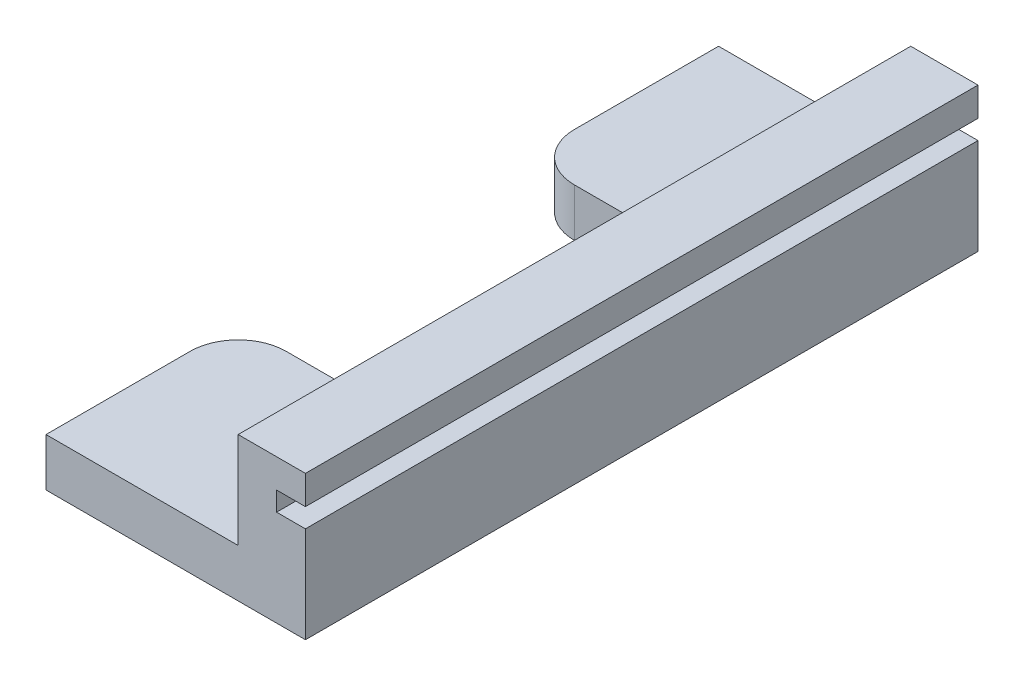
ISO-10303-21;
HEADER;
FILE_DESCRIPTION(('STEP AP214'),'2;1');
FILE_NAME('part.step','',(''),(''),'','','');
FILE_SCHEMA(('AUTOMOTIVE_DESIGN { 1 0 10303 214 1 1 1 1 }'));
ENDSEC;
DATA;
#1=APPLICATION_CONTEXT('core data for automotive mechanical design processes');
#2=APPLICATION_PROTOCOL_DEFINITION('international standard','automotive_design',2000,#1);
#3=PRODUCT_CONTEXT('',#1,'mechanical');
#4=PRODUCT('Part','Part','',(#3));
#5=PRODUCT_RELATED_PRODUCT_CATEGORY('part','',(#4));
#6=PRODUCT_DEFINITION_FORMATION('','',#4);
#7=PRODUCT_DEFINITION_CONTEXT('part definition',#1,'design');
#8=PRODUCT_DEFINITION('design','',#6,#7);
#9=PRODUCT_DEFINITION_SHAPE('','',#8);
#10=(LENGTH_UNIT() NAMED_UNIT(*) SI_UNIT(.MILLI.,.METRE.));
#11=(NAMED_UNIT(*) PLANE_ANGLE_UNIT() SI_UNIT($,.RADIAN.));
#12=(NAMED_UNIT(*) SI_UNIT($,.STERADIAN.) SOLID_ANGLE_UNIT());
#13=UNCERTAINTY_MEASURE_WITH_UNIT(LENGTH_MEASURE(1.E-05),#10,'distance_accuracy_value','');
#14=(GEOMETRIC_REPRESENTATION_CONTEXT(3) GLOBAL_UNCERTAINTY_ASSIGNED_CONTEXT((#13)) GLOBAL_UNIT_ASSIGNED_CONTEXT((#10,
#11,#12)) REPRESENTATION_CONTEXT('',''));
#15=CARTESIAN_POINT('',(0.,0.,0.));
#16=DIRECTION('',(0.,0.,1.));
#17=DIRECTION('',(1.,0.,0.));
#18=AXIS2_PLACEMENT_3D('',#15,#16,#17);
#19=CARTESIAN_POINT('',(0.,0.,0.));
#20=DIRECTION('',(0.,-1.,0.));
#21=DIRECTION('',(0.,0.,-1.));
#22=AXIS2_PLACEMENT_3D('',#19,#20,#21);
#23=PLANE('',#22);
#24=DIRECTION('',(0.,0.,1.));
#25=VECTOR('',#24,1.);
#26=CARTESIAN_POINT('',(-20.,0.,-70.));
#27=LINE('',#26,#25);
#28=CARTESIAN_POINT('',(-20.,0.,-15.));
#29=VERTEX_POINT('',#28);
#30=CARTESIAN_POINT('',(-20.,0.,0.));
#31=VERTEX_POINT('',#30);
#32=EDGE_CURVE('E184',#29,#31,#27,.T.);
#33=ORIENTED_EDGE('',*,*,#32,.F.);
#34=CARTESIAN_POINT('',(-15.,0.,-15.));
#35=DIRECTION('',(0.,-1.,0.));
#36=DIRECTION('',(0.,0.,-1.));
#37=AXIS2_PLACEMENT_3D('',#34,#35,#36);
#38=CIRCLE('',#37,5.);
#39=CARTESIAN_POINT('',(-15.,0.,-20.));
#40=VERTEX_POINT('',#39);
#41=EDGE_CURVE('E302',#29,#40,#38,.T.);
#42=ORIENTED_EDGE('',*,*,#41,.T.);
#43=DIRECTION('',(1.,0.,0.));
#44=VECTOR('',#43,1.);
#45=CARTESIAN_POINT('',(0.,0.,-20.));
#46=LINE('',#45,#44);
#47=CARTESIAN_POINT('',(-10.,0.,-20.));
#48=VERTEX_POINT('',#47);
#49=EDGE_CURVE('E354',#40,#48,#46,.T.);
#50=ORIENTED_EDGE('',*,*,#49,.T.);
#51=CARTESIAN_POINT('',(-10.,0.,-25.));
#52=DIRECTION('',(0.,-1.,0.));
#53=DIRECTION('',(0.,0.,-1.));
#54=AXIS2_PLACEMENT_3D('',#51,#52,#53);
#55=CIRCLE('',#54,5.);
#56=CARTESIAN_POINT('',(-5.,0.,-25.));
#57=VERTEX_POINT('',#56);
#58=EDGE_CURVE('E325',#48,#57,#55,.F.);
#59=ORIENTED_EDGE('',*,*,#58,.T.);
#60=DIRECTION('',(0.,0.,-1.));
#61=VECTOR('',#60,1.);
#62=CARTESIAN_POINT('',(-5.,0.,0.));
#63=LINE('',#62,#61);
#64=CARTESIAN_POINT('',(-5.,0.,-45.));
#65=VERTEX_POINT('',#64);
#66=EDGE_CURVE('E196',#57,#65,#63,.T.);
#67=ORIENTED_EDGE('',*,*,#66,.T.);
#68=CARTESIAN_POINT('',(-10.,0.,-45.));
#69=DIRECTION('',(0.,-1.,0.));
#70=DIRECTION('',(0.,0.,-1.));
#71=AXIS2_PLACEMENT_3D('',#68,#69,#70);
#72=CIRCLE('',#71,5.);
#73=CARTESIAN_POINT('',(-10.,0.,-50.));
#74=VERTEX_POINT('',#73);
#75=EDGE_CURVE('E11',#65,#74,#72,.F.);
#76=ORIENTED_EDGE('',*,*,#75,.T.);
#77=DIRECTION('',(-1.,0.,0.));
#78=VECTOR('',#77,1.);
#79=CARTESIAN_POINT('',(0.,0.,-50.));
#80=LINE('',#79,#78);
#81=CARTESIAN_POINT('',(-15.,0.,-50.));
#82=VERTEX_POINT('',#81);
#83=EDGE_CURVE('E350',#74,#82,#80,.T.);
#84=ORIENTED_EDGE('',*,*,#83,.T.);
#85=CARTESIAN_POINT('',(-15.,0.,-55.));
#86=DIRECTION('',(0.,-1.,0.));
#87=DIRECTION('',(0.,0.,-1.));
#88=AXIS2_PLACEMENT_3D('',#85,#86,#87);
#89=CIRCLE('',#88,5.);
#90=CARTESIAN_POINT('',(-20.,0.,-55.));
#91=VERTEX_POINT('',#90);
#92=EDGE_CURVE('E55',#82,#91,#89,.T.);
#93=ORIENTED_EDGE('',*,*,#92,.T.);
#94=CARTESIAN_POINT('',(-20.,0.,-70.));
#95=VERTEX_POINT('',#94);
#96=EDGE_CURVE('E179',#95,#91,#27,.T.);
#97=ORIENTED_EDGE('',*,*,#96,.F.);
#98=DIRECTION('',(-1.,0.,0.));
#99=VECTOR('',#98,1.);
#100=CARTESIAN_POINT('',(0.,0.,-70.));
#101=LINE('',#100,#99);
#102=CARTESIAN_POINT('',(7.,0.,-70.));
#103=VERTEX_POINT('',#102);
#104=EDGE_CURVE('E165',#103,#95,#101,.T.);
#105=ORIENTED_EDGE('',*,*,#104,.F.);
#106=DIRECTION('',(0.,0.,-1.));
#107=VECTOR('',#106,1.);
#108=CARTESIAN_POINT('',(7.,0.,0.));
#109=LINE('',#108,#107);
#110=CARTESIAN_POINT('',(7.,0.,0.));
#111=VERTEX_POINT('',#110);
#112=EDGE_CURVE('E214',#111,#103,#109,.T.);
#113=ORIENTED_EDGE('',*,*,#112,.F.);
#114=DIRECTION('',(1.,0.,0.));
#115=VECTOR('',#114,1.);
#116=CARTESIAN_POINT('',(0.,0.,0.));
#117=LINE('',#116,#115);
#118=EDGE_CURVE('E177',#31,#111,#117,.T.);
#119=ORIENTED_EDGE('',*,*,#118,.F.);
#120=EDGE_LOOP('',(#33,#42,#50,#59,#67,#76,#84,#93,#97,#105,#113,#119));
#121=FACE_BOUND('',#120,.T.);
#122=ADVANCED_FACE('F39',(#121),#23,.T.);
#123=CARTESIAN_POINT('',(-20.,5.,-70.));
#124=DIRECTION('',(0.,-1.,0.));
#125=DIRECTION('',(0.,0.,-1.));
#126=AXIS2_PLACEMENT_3D('',#123,#124,#125);
#127=PLANE('',#126);
#128=DIRECTION('',(-1.,0.,0.));
#129=VECTOR('',#128,1.);
#130=CARTESIAN_POINT('',(0.,5.,-20.));
#131=LINE('',#130,#129);
#132=CARTESIAN_POINT('',(-10.,5.,-20.));
#133=VERTEX_POINT('',#132);
#134=CARTESIAN_POINT('',(-15.,5.,-20.));
#135=VERTEX_POINT('',#134);
#136=EDGE_CURVE('E346',#133,#135,#131,.T.);
#137=ORIENTED_EDGE('',*,*,#136,.T.);
#138=CARTESIAN_POINT('',(-15.,5.,-15.));
#139=DIRECTION('',(0.,-1.,0.));
#140=DIRECTION('',(0.,0.,-1.));
#141=AXIS2_PLACEMENT_3D('',#138,#139,#140);
#142=CIRCLE('',#141,5.);
#143=CARTESIAN_POINT('',(-20.,5.,-15.));
#144=VERTEX_POINT('',#143);
#145=EDGE_CURVE('E294',#135,#144,#142,.F.);
#146=ORIENTED_EDGE('',*,*,#145,.T.);
#147=DIRECTION('',(0.,0.,-1.));
#148=VECTOR('',#147,1.);
#149=CARTESIAN_POINT('',(-20.,5.,-70.));
#150=LINE('',#149,#148);
#151=CARTESIAN_POINT('',(-20.,5.,0.));
#152=VERTEX_POINT('',#151);
#153=EDGE_CURVE('E203',#152,#144,#150,.T.);
#154=ORIENTED_EDGE('',*,*,#153,.F.);
#155=DIRECTION('',(1.,0.,0.));
#156=VECTOR('',#155,1.);
#157=CARTESIAN_POINT('',(-20.,5.,0.));
#158=LINE('',#157,#156);
#159=CARTESIAN_POINT('',(0.,5.,0.));
#160=VERTEX_POINT('',#159);
#161=EDGE_CURVE('E210',#152,#160,#158,.T.);
#162=ORIENTED_EDGE('',*,*,#161,.T.);
#163=DIRECTION('',(0.,0.,-1.));
#164=VECTOR('',#163,1.);
#165=CARTESIAN_POINT('',(0.,5.,-70.));
#166=LINE('',#165,#164);
#167=CARTESIAN_POINT('',(0.,5.,-70.));
#168=VERTEX_POINT('',#167);
#169=EDGE_CURVE('E191',#160,#168,#166,.T.);
#170=ORIENTED_EDGE('',*,*,#169,.T.);
#171=DIRECTION('',(1.,0.,0.));
#172=VECTOR('',#171,1.);
#173=CARTESIAN_POINT('',(-20.,5.,-70.));
#174=LINE('',#173,#172);
#175=CARTESIAN_POINT('',(-20.,5.,-70.));
#176=VERTEX_POINT('',#175);
#177=EDGE_CURVE('E206',#176,#168,#174,.T.);
#178=ORIENTED_EDGE('',*,*,#177,.F.);
#179=CARTESIAN_POINT('',(-20.,5.,-55.));
#180=VERTEX_POINT('',#179);
#181=EDGE_CURVE('E188',#180,#176,#150,.T.);
#182=ORIENTED_EDGE('',*,*,#181,.F.);
#183=CARTESIAN_POINT('',(-15.,5.,-55.));
#184=DIRECTION('',(0.,-1.,0.));
#185=DIRECTION('',(0.,0.,-1.));
#186=AXIS2_PLACEMENT_3D('',#183,#184,#185);
#187=CIRCLE('',#186,5.);
#188=CARTESIAN_POINT('',(-15.,5.,-50.));
#189=VERTEX_POINT('',#188);
#190=EDGE_CURVE('E291',#180,#189,#187,.F.);
#191=ORIENTED_EDGE('',*,*,#190,.T.);
#192=DIRECTION('',(1.,0.,0.));
#193=VECTOR('',#192,1.);
#194=CARTESIAN_POINT('',(0.,5.,-50.));
#195=LINE('',#194,#193);
#196=CARTESIAN_POINT('',(-10.,5.,-50.));
#197=VERTEX_POINT('',#196);
#198=EDGE_CURVE('E336',#189,#197,#195,.T.);
#199=ORIENTED_EDGE('',*,*,#198,.T.);
#200=CARTESIAN_POINT('',(-10.,5.,-45.));
#201=DIRECTION('',(0.,-1.,0.));
#202=DIRECTION('',(0.,0.,-1.));
#203=AXIS2_PLACEMENT_3D('',#200,#201,#202);
#204=CIRCLE('',#203,5.);
#205=CARTESIAN_POINT('',(-5.,5.,-45.));
#206=VERTEX_POINT('',#205);
#207=EDGE_CURVE('E48',#197,#206,#204,.T.);
#208=ORIENTED_EDGE('',*,*,#207,.T.);
#209=DIRECTION('',(0.,0.,1.));
#210=VECTOR('',#209,1.);
#211=CARTESIAN_POINT('',(-5.,5.,0.));
#212=LINE('',#211,#210);
#213=CARTESIAN_POINT('',(-5.,5.,-25.));
#214=VERTEX_POINT('',#213);
#215=EDGE_CURVE('E334',#206,#214,#212,.T.);
#216=ORIENTED_EDGE('',*,*,#215,.T.);
#217=CARTESIAN_POINT('',(-10.,5.,-25.));
#218=DIRECTION('',(0.,-1.,0.));
#219=DIRECTION('',(0.,0.,-1.));
#220=AXIS2_PLACEMENT_3D('',#217,#218,#219);
#221=CIRCLE('',#220,5.);
#222=EDGE_CURVE('E322',#214,#133,#221,.T.);
#223=ORIENTED_EDGE('',*,*,#222,.T.);
#224=EDGE_LOOP('',(#137,#146,#154,#162,#170,#178,#182,#191,#199,#208,#216,#223));
#225=FACE_BOUND('',#224,.T.);
#226=ADVANCED_FACE('F333',(#225),#127,.F.);
#227=CARTESIAN_POINT('',(-20.,0.,0.));
#228=DIRECTION('',(1.,0.,0.));
#229=DIRECTION('',(0.,0.,-1.));
#230=AXIS2_PLACEMENT_3D('',#227,#228,#229);
#231=PLANE('',#230);
#232=ORIENTED_EDGE('',*,*,#153,.T.);
#233=DIRECTION('',(0.,1.,0.));
#234=VECTOR('',#233,1.);
#235=CARTESIAN_POINT('',(-20.,0.,-15.));
#236=LINE('',#235,#234);
#237=EDGE_CURVE('E297',#144,#29,#236,.F.);
#238=ORIENTED_EDGE('',*,*,#237,.T.);
#239=ORIENTED_EDGE('',*,*,#32,.T.);
#240=DIRECTION('',(0.,1.,0.));
#241=VECTOR('',#240,1.);
#242=CARTESIAN_POINT('',(-20.,0.,0.));
#243=LINE('',#242,#241);
#244=EDGE_CURVE('E183',#31,#152,#243,.T.);
#245=ORIENTED_EDGE('',*,*,#244,.T.);
#246=EDGE_LOOP('',(#232,#238,#239,#245));
#247=FACE_BOUND('',#246,.T.);
#248=ADVANCED_FACE('F378',(#247),#231,.F.);
#249=ORIENTED_EDGE('',*,*,#96,.T.);
#250=DIRECTION('',(0.,-1.,0.));
#251=VECTOR('',#250,1.);
#252=CARTESIAN_POINT('',(-20.,5.,-55.));
#253=LINE('',#252,#251);
#254=EDGE_CURVE('E312',#91,#180,#253,.F.);
#255=ORIENTED_EDGE('',*,*,#254,.T.);
#256=ORIENTED_EDGE('',*,*,#181,.T.);
#257=DIRECTION('',(0.,-1.,0.));
#258=VECTOR('',#257,1.);
#259=CARTESIAN_POINT('',(-20.,0.,-70.));
#260=LINE('',#259,#258);
#261=EDGE_CURVE('E169',#176,#95,#260,.T.);
#262=ORIENTED_EDGE('',*,*,#261,.T.);
#263=EDGE_LOOP('',(#249,#255,#256,#262));
#264=FACE_BOUND('',#263,.T.);
#265=ADVANCED_FACE('F186',(#264),#231,.F.);
#266=CARTESIAN_POINT('',(0.,5.,0.));
#267=DIRECTION('',(1.,0.,0.));
#268=DIRECTION('',(0.,0.,-1.));
#269=AXIS2_PLACEMENT_3D('',#266,#267,#268);
#270=PLANE('',#269);
#271=ORIENTED_EDGE('',*,*,#169,.F.);
#272=DIRECTION('',(0.,-1.,0.));
#273=VECTOR('',#272,1.);
#274=CARTESIAN_POINT('',(0.,5.,0.));
#275=LINE('',#274,#273);
#276=CARTESIAN_POINT('',(0.,15.,0.));
#277=VERTEX_POINT('',#276);
#278=EDGE_CURVE('E280',#277,#160,#275,.T.);
#279=ORIENTED_EDGE('',*,*,#278,.F.);
#280=DIRECTION('',(0.,0.,1.));
#281=VECTOR('',#280,1.);
#282=CARTESIAN_POINT('',(0.,15.,0.));
#283=LINE('',#282,#281);
#284=CARTESIAN_POINT('',(0.,15.,-70.));
#285=VERTEX_POINT('',#284);
#286=EDGE_CURVE('E252',#285,#277,#283,.T.);
#287=ORIENTED_EDGE('',*,*,#286,.F.);
#288=DIRECTION('',(0.,-1.,0.));
#289=VECTOR('',#288,1.);
#290=CARTESIAN_POINT('',(0.,5.,-70.));
#291=LINE('',#290,#289);
#292=EDGE_CURVE('E176',#285,#168,#291,.T.);
#293=ORIENTED_EDGE('',*,*,#292,.T.);
#294=EDGE_LOOP('',(#271,#279,#287,#293));
#295=FACE_BOUND('',#294,.T.);
#296=ADVANCED_FACE('F393',(#295),#270,.F.);
#297=CARTESIAN_POINT('',(0.,5.,0.));
#298=DIRECTION('',(0.,0.,-1.));
#299=DIRECTION('',(-1.,0.,0.));
#300=AXIS2_PLACEMENT_3D('',#297,#298,#299);
#301=PLANE('',#300);
#302=ORIENTED_EDGE('',*,*,#118,.T.);
#303=DIRECTION('',(0.,-1.,0.));
#304=VECTOR('',#303,1.);
#305=CARTESIAN_POINT('',(7.,15.,0.));
#306=LINE('',#305,#304);
#307=CARTESIAN_POINT('',(7.,10.,0.));
#308=VERTEX_POINT('',#307);
#309=EDGE_CURVE('E270',#308,#111,#306,.T.);
#310=ORIENTED_EDGE('',*,*,#309,.F.);
#311=DIRECTION('',(1.,0.,0.));
#312=VECTOR('',#311,1.);
#313=CARTESIAN_POINT('',(4.,10.,0.));
#314=LINE('',#313,#312);
#315=CARTESIAN_POINT('',(4.,10.,0.));
#316=VERTEX_POINT('',#315);
#317=EDGE_CURVE('E243',#316,#308,#314,.T.);
#318=ORIENTED_EDGE('',*,*,#317,.F.);
#319=DIRECTION('',(0.,1.,0.));
#320=VECTOR('',#319,1.);
#321=CARTESIAN_POINT('',(4.,10.,0.));
#322=LINE('',#321,#320);
#323=CARTESIAN_POINT('',(4.,11.9981435230443,0.));
#324=VERTEX_POINT('',#323);
#325=EDGE_CURVE('E230',#316,#324,#322,.T.);
#326=ORIENTED_EDGE('',*,*,#325,.T.);
#327=DIRECTION('',(1.,0.,0.));
#328=VECTOR('',#327,1.);
#329=CARTESIAN_POINT('',(4.,11.9981435230443,0.));
#330=LINE('',#329,#328);
#331=CARTESIAN_POINT('',(7.,11.9981435230443,0.));
#332=VERTEX_POINT('',#331);
#333=EDGE_CURVE('E234',#324,#332,#330,.T.);
#334=ORIENTED_EDGE('',*,*,#333,.T.);
#335=CARTESIAN_POINT('',(7.,15.,0.));
#336=VERTEX_POINT('',#335);
#337=EDGE_CURVE('E271',#336,#332,#306,.T.);
#338=ORIENTED_EDGE('',*,*,#337,.F.);
#339=DIRECTION('',(1.,0.,0.));
#340=VECTOR('',#339,1.);
#341=CARTESIAN_POINT('',(0.,15.,0.));
#342=LINE('',#341,#340);
#343=EDGE_CURVE('E256',#277,#336,#342,.T.);
#344=ORIENTED_EDGE('',*,*,#343,.F.);
#345=ORIENTED_EDGE('',*,*,#278,.T.);
#346=ORIENTED_EDGE('',*,*,#161,.F.);
#347=ORIENTED_EDGE('',*,*,#244,.F.);
#348=EDGE_LOOP('',(#302,#310,#318,#326,#334,#338,#344,#345,#346,#347));
#349=FACE_BOUND('',#348,.T.);
#350=ADVANCED_FACE('F384',(#349),#301,.F.);
#351=CARTESIAN_POINT('',(0.,5.,-70.));
#352=DIRECTION('',(0.,0.,1.));
#353=DIRECTION('',(1.,0.,0.));
#354=AXIS2_PLACEMENT_3D('',#351,#352,#353);
#355=PLANE('',#354);
#356=DIRECTION('',(0.,-1.,0.));
#357=VECTOR('',#356,1.);
#358=CARTESIAN_POINT('',(7.,15.,-70.));
#359=LINE('',#358,#357);
#360=CARTESIAN_POINT('',(7.,10.,-70.));
#361=VERTEX_POINT('',#360);
#362=EDGE_CURVE('E172',#361,#103,#359,.T.);
#363=ORIENTED_EDGE('',*,*,#362,.T.);
#364=ORIENTED_EDGE('',*,*,#104,.T.);
#365=ORIENTED_EDGE('',*,*,#261,.F.);
#366=ORIENTED_EDGE('',*,*,#177,.T.);
#367=ORIENTED_EDGE('',*,*,#292,.F.);
#368=DIRECTION('',(-1.,0.,0.));
#369=VECTOR('',#368,1.);
#370=CARTESIAN_POINT('',(0.,15.,-70.));
#371=LINE('',#370,#369);
#372=CARTESIAN_POINT('',(7.,15.,-70.));
#373=VERTEX_POINT('',#372);
#374=EDGE_CURVE('E262',#373,#285,#371,.T.);
#375=ORIENTED_EDGE('',*,*,#374,.F.);
#376=CARTESIAN_POINT('',(7.,11.9981435230443,-70.));
#377=VERTEX_POINT('',#376);
#378=EDGE_CURVE('E266',#373,#377,#359,.T.);
#379=ORIENTED_EDGE('',*,*,#378,.T.);
#380=DIRECTION('',(1.,0.,0.));
#381=VECTOR('',#380,1.);
#382=CARTESIAN_POINT('',(4.,11.9981435230443,-70.));
#383=LINE('',#382,#381);
#384=CARTESIAN_POINT('',(4.,11.9981435230443,-70.));
#385=VERTEX_POINT('',#384);
#386=EDGE_CURVE('E249',#385,#377,#383,.T.);
#387=ORIENTED_EDGE('',*,*,#386,.F.);
#388=DIRECTION('',(0.,1.,0.));
#389=VECTOR('',#388,1.);
#390=CARTESIAN_POINT('',(4.,10.,-70.));
#391=LINE('',#390,#389);
#392=CARTESIAN_POINT('',(4.,10.,-70.));
#393=VERTEX_POINT('',#392);
#394=EDGE_CURVE('E221',#393,#385,#391,.T.);
#395=ORIENTED_EDGE('',*,*,#394,.F.);
#396=DIRECTION('',(1.,0.,0.));
#397=VECTOR('',#396,1.);
#398=CARTESIAN_POINT('',(4.,10.,-70.));
#399=LINE('',#398,#397);
#400=EDGE_CURVE('E246',#393,#361,#399,.T.);
#401=ORIENTED_EDGE('',*,*,#400,.T.);
#402=EDGE_LOOP('',(#363,#364,#365,#366,#367,#375,#379,#387,#395,#401));
#403=FACE_BOUND('',#402,.T.);
#404=ADVANCED_FACE('F166',(#403),#355,.F.);
#405=CARTESIAN_POINT('',(7.,15.,0.));
#406=DIRECTION('',(-1.,0.,0.));
#407=DIRECTION('',(0.,0.,1.));
#408=AXIS2_PLACEMENT_3D('',#405,#406,#407);
#409=PLANE('',#408);
#410=DIRECTION('',(0.,0.,-1.));
#411=VECTOR('',#410,1.);
#412=CARTESIAN_POINT('',(7.,11.9981435230443,0.));
#413=LINE('',#412,#411);
#414=EDGE_CURVE('E217',#332,#377,#413,.T.);
#415=ORIENTED_EDGE('',*,*,#414,.T.);
#416=ORIENTED_EDGE('',*,*,#378,.F.);
#417=DIRECTION('',(0.,0.,-1.));
#418=VECTOR('',#417,1.);
#419=CARTESIAN_POINT('',(7.,15.,0.));
#420=LINE('',#419,#418);
#421=EDGE_CURVE('E259',#336,#373,#420,.T.);
#422=ORIENTED_EDGE('',*,*,#421,.F.);
#423=ORIENTED_EDGE('',*,*,#337,.T.);
#424=EDGE_LOOP('',(#415,#416,#422,#423));
#425=FACE_BOUND('',#424,.T.);
#426=ADVANCED_FACE('F396',(#425),#409,.F.);
#427=ORIENTED_EDGE('',*,*,#362,.F.);
#428=DIRECTION('',(0.,0.,-1.));
#429=VECTOR('',#428,1.);
#430=CARTESIAN_POINT('',(7.,10.,0.));
#431=LINE('',#430,#429);
#432=EDGE_CURVE('E222',#308,#361,#431,.T.);
#433=ORIENTED_EDGE('',*,*,#432,.F.);
#434=ORIENTED_EDGE('',*,*,#309,.T.);
#435=ORIENTED_EDGE('',*,*,#112,.T.);
#436=EDGE_LOOP('',(#427,#433,#434,#435));
#437=FACE_BOUND('',#436,.T.);
#438=ADVANCED_FACE('F413',(#437),#409,.F.);
#439=CARTESIAN_POINT('',(0.,15.,0.));
#440=DIRECTION('',(0.,-1.,0.));
#441=DIRECTION('',(0.,0.,-1.));
#442=AXIS2_PLACEMENT_3D('',#439,#440,#441);
#443=PLANE('',#442);
#444=ORIENTED_EDGE('',*,*,#286,.T.);
#445=ORIENTED_EDGE('',*,*,#343,.T.);
#446=ORIENTED_EDGE('',*,*,#421,.T.);
#447=ORIENTED_EDGE('',*,*,#374,.T.);
#448=EDGE_LOOP('',(#444,#445,#446,#447));
#449=FACE_BOUND('',#448,.T.);
#450=ADVANCED_FACE('F390',(#449),#443,.F.);
#451=CARTESIAN_POINT('',(4.,11.9981435230443,0.));
#452=DIRECTION('',(0.,-1.,0.));
#453=DIRECTION('',(0.,0.,-1.));
#454=AXIS2_PLACEMENT_3D('',#451,#452,#453);
#455=PLANE('',#454);
#456=ORIENTED_EDGE('',*,*,#414,.F.);
#457=ORIENTED_EDGE('',*,*,#333,.F.);
#458=DIRECTION('',(0.,0.,-1.));
#459=VECTOR('',#458,1.);
#460=CARTESIAN_POINT('',(4.,11.9981435230443,0.));
#461=LINE('',#460,#459);
#462=EDGE_CURVE('E218',#324,#385,#461,.T.);
#463=ORIENTED_EDGE('',*,*,#462,.T.);
#464=ORIENTED_EDGE('',*,*,#386,.T.);
#465=EDGE_LOOP('',(#456,#457,#463,#464));
#466=FACE_BOUND('',#465,.T.);
#467=ADVANCED_FACE('F400',(#466),#455,.T.);
#468=CARTESIAN_POINT('',(4.,10.,0.));
#469=DIRECTION('',(0.,-1.,0.));
#470=DIRECTION('',(0.,0.,-1.));
#471=AXIS2_PLACEMENT_3D('',#468,#469,#470);
#472=PLANE('',#471);
#473=ORIENTED_EDGE('',*,*,#432,.T.);
#474=ORIENTED_EDGE('',*,*,#400,.F.);
#475=DIRECTION('',(0.,0.,-1.));
#476=VECTOR('',#475,1.);
#477=CARTESIAN_POINT('',(4.,10.,0.));
#478=LINE('',#477,#476);
#479=EDGE_CURVE('E226',#316,#393,#478,.T.);
#480=ORIENTED_EDGE('',*,*,#479,.F.);
#481=ORIENTED_EDGE('',*,*,#317,.T.);
#482=EDGE_LOOP('',(#473,#474,#480,#481));
#483=FACE_BOUND('',#482,.T.);
#484=ADVANCED_FACE('F407',(#483),#472,.F.);
#485=CARTESIAN_POINT('',(4.,0.,0.));
#486=DIRECTION('',(1.,0.,0.));
#487=DIRECTION('',(0.,0.,-1.));
#488=AXIS2_PLACEMENT_3D('',#485,#486,#487);
#489=PLANE('',#488);
#490=ORIENTED_EDGE('',*,*,#462,.F.);
#491=ORIENTED_EDGE('',*,*,#325,.F.);
#492=ORIENTED_EDGE('',*,*,#479,.T.);
#493=ORIENTED_EDGE('',*,*,#394,.T.);
#494=EDGE_LOOP('',(#490,#491,#492,#493));
#495=FACE_BOUND('',#494,.T.);
#496=ADVANCED_FACE('F403',(#495),#489,.T.);
#497=CARTESIAN_POINT('',(0.,-15.,-20.));
#498=DIRECTION('',(0.,0.,-1.));
#499=DIRECTION('',(-1.,0.,0.));
#500=AXIS2_PLACEMENT_3D('',#497,#498,#499);
#501=PLANE('',#500);
#502=ORIENTED_EDGE('',*,*,#49,.F.);
#503=DIRECTION('',(0.,1.,0.));
#504=VECTOR('',#503,1.);
#505=CARTESIAN_POINT('',(-15.,5.,-20.));
#506=LINE('',#505,#504);
#507=EDGE_CURVE('E287',#40,#135,#506,.T.);
#508=ORIENTED_EDGE('',*,*,#507,.T.);
#509=ORIENTED_EDGE('',*,*,#136,.F.);
#510=DIRECTION('',(0.,1.,0.));
#511=VECTOR('',#510,1.);
#512=CARTESIAN_POINT('',(-10.,0.,-20.));
#513=LINE('',#512,#511);
#514=EDGE_CURVE('E284',#133,#48,#513,.F.);
#515=ORIENTED_EDGE('',*,*,#514,.T.);
#516=EDGE_LOOP('',(#502,#508,#509,#515));
#517=FACE_BOUND('',#516,.T.);
#518=ADVANCED_FACE('F367',(#517),#501,.T.);
#519=CARTESIAN_POINT('',(0.,-15.,-50.));
#520=DIRECTION('',(0.,0.,1.));
#521=DIRECTION('',(0.,-1.,0.));
#522=AXIS2_PLACEMENT_3D('',#519,#520,#521);
#523=PLANE('',#522);
#524=ORIENTED_EDGE('',*,*,#198,.F.);
#525=DIRECTION('',(0.,-1.,0.));
#526=VECTOR('',#525,1.);
#527=CARTESIAN_POINT('',(-15.,0.,-50.));
#528=LINE('',#527,#526);
#529=EDGE_CURVE('E309',#189,#82,#528,.T.);
#530=ORIENTED_EDGE('',*,*,#529,.T.);
#531=ORIENTED_EDGE('',*,*,#83,.F.);
#532=DIRECTION('',(0.,1.,0.));
#533=VECTOR('',#532,1.);
#534=CARTESIAN_POINT('',(-10.,5.,-50.));
#535=LINE('',#534,#533);
#536=EDGE_CURVE('E305',#74,#197,#535,.T.);
#537=ORIENTED_EDGE('',*,*,#536,.T.);
#538=EDGE_LOOP('',(#524,#530,#531,#537));
#539=FACE_BOUND('',#538,.T.);
#540=ADVANCED_FACE('F352',(#539),#523,.T.);
#541=CARTESIAN_POINT('',(-5.,-15.,0.));
#542=DIRECTION('',(-1.,0.,0.));
#543=DIRECTION('',(0.,0.,1.));
#544=AXIS2_PLACEMENT_3D('',#541,#542,#543);
#545=PLANE('',#544);
#546=ORIENTED_EDGE('',*,*,#66,.F.);
#547=DIRECTION('',(0.,1.,0.));
#548=VECTOR('',#547,1.);
#549=CARTESIAN_POINT('',(-5.,5.,-25.));
#550=LINE('',#549,#548);
#551=EDGE_CURVE('E318',#57,#214,#550,.T.);
#552=ORIENTED_EDGE('',*,*,#551,.T.);
#553=ORIENTED_EDGE('',*,*,#215,.F.);
#554=DIRECTION('',(0.,1.,0.));
#555=VECTOR('',#554,1.);
#556=CARTESIAN_POINT('',(-5.,0.,-45.));
#557=LINE('',#556,#555);
#558=EDGE_CURVE('E315',#206,#65,#557,.F.);
#559=ORIENTED_EDGE('',*,*,#558,.T.);
#560=EDGE_LOOP('',(#546,#552,#553,#559));
#561=FACE_BOUND('',#560,.T.);
#562=ADVANCED_FACE('F342',(#561),#545,.T.);
#563=CARTESIAN_POINT('',(-15.,-15.,-15.));
#564=DIRECTION('',(0.,-1.,0.));
#565=DIRECTION('',(0.,0.,-1.));
#566=AXIS2_PLACEMENT_3D('',#563,#564,#565);
#567=CYLINDRICAL_SURFACE('',#566,5.);
#568=ORIENTED_EDGE('',*,*,#41,.F.);
#569=ORIENTED_EDGE('',*,*,#237,.F.);
#570=ORIENTED_EDGE('',*,*,#145,.F.);
#571=ORIENTED_EDGE('',*,*,#507,.F.);
#572=EDGE_LOOP('',(#568,#569,#570,#571));
#573=FACE_BOUND('',#572,.T.);
#574=ADVANCED_FACE('F375',(#573),#567,.T.);
#575=CARTESIAN_POINT('',(-15.,-15.,-55.));
#576=DIRECTION('',(0.,1.,0.));
#577=DIRECTION('',(0.,0.,1.));
#578=AXIS2_PLACEMENT_3D('',#575,#576,#577);
#579=CYLINDRICAL_SURFACE('',#578,5.);
#580=ORIENTED_EDGE('',*,*,#190,.F.);
#581=ORIENTED_EDGE('',*,*,#254,.F.);
#582=ORIENTED_EDGE('',*,*,#92,.F.);
#583=ORIENTED_EDGE('',*,*,#529,.F.);
#584=EDGE_LOOP('',(#580,#581,#582,#583));
#585=FACE_BOUND('',#584,.T.);
#586=ADVANCED_FACE('F436',(#585),#579,.T.);
#587=CARTESIAN_POINT('',(-10.,-15.,-25.));
#588=DIRECTION('',(0.,-1.,0.));
#589=DIRECTION('',(0.,0.,-1.));
#590=AXIS2_PLACEMENT_3D('',#587,#588,#589);
#591=CYLINDRICAL_SURFACE('',#590,5.);
#592=ORIENTED_EDGE('',*,*,#58,.F.);
#593=ORIENTED_EDGE('',*,*,#514,.F.);
#594=ORIENTED_EDGE('',*,*,#222,.F.);
#595=ORIENTED_EDGE('',*,*,#551,.F.);
#596=EDGE_LOOP('',(#592,#593,#594,#595));
#597=FACE_BOUND('',#596,.T.);
#598=ADVANCED_FACE('F371',(#597),#591,.F.);
#599=CARTESIAN_POINT('',(-10.,-15.,-45.));
#600=DIRECTION('',(0.,-1.,0.));
#601=DIRECTION('',(0.,0.,-1.));
#602=AXIS2_PLACEMENT_3D('',#599,#600,#601);
#603=CYLINDRICAL_SURFACE('',#602,5.);
#604=ORIENTED_EDGE('',*,*,#75,.F.);
#605=ORIENTED_EDGE('',*,*,#558,.F.);
#606=ORIENTED_EDGE('',*,*,#207,.F.);
#607=ORIENTED_EDGE('',*,*,#536,.F.);
#608=EDGE_LOOP('',(#604,#605,#606,#607));
#609=FACE_BOUND('',#608,.T.);
#610=ADVANCED_FACE('F41',(#609),#603,.F.);
#611=CLOSED_SHELL('',(#122,#226,#248,#265,#296,#350,#404,#426,#438,#450,#467,#484,#496,#518,
#540,#562,#574,#586,#598,#610));
#612=MANIFOLD_SOLID_BREP('B2',#611);
#613=ADVANCED_BREP_SHAPE_REPRESENTATION('',(#18,#612),#14);
#614=SHAPE_DEFINITION_REPRESENTATION(#9,#613);
ENDSEC;
END-ISO-10303-21;
